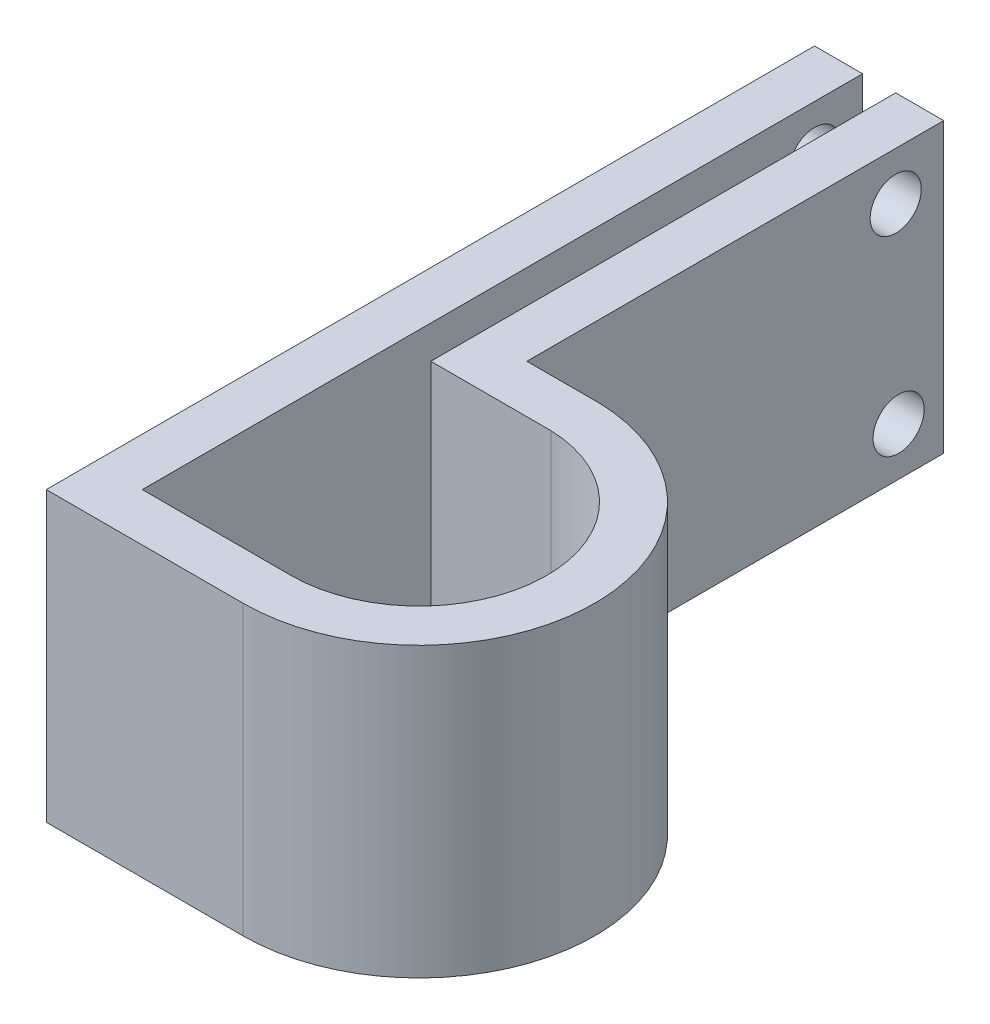
ISO-10303-21;
HEADER;
FILE_DESCRIPTION(('STEP AP214'),'2;1');
FILE_NAME('part.step','',(''),(''),'','','');
FILE_SCHEMA(('AUTOMOTIVE_DESIGN { 1 0 10303 214 1 1 1 1 }'));
ENDSEC;
DATA;
#1=APPLICATION_CONTEXT('core data for automotive mechanical design processes');
#2=APPLICATION_PROTOCOL_DEFINITION('international standard','automotive_design',2000,#1);
#3=PRODUCT_CONTEXT('',#1,'mechanical');
#4=PRODUCT('Part','Part','',(#3));
#5=PRODUCT_RELATED_PRODUCT_CATEGORY('part','',(#4));
#6=PRODUCT_DEFINITION_FORMATION('','',#4);
#7=PRODUCT_DEFINITION_CONTEXT('part definition',#1,'design');
#8=PRODUCT_DEFINITION('design','',#6,#7);
#9=PRODUCT_DEFINITION_SHAPE('','',#8);
#10=(LENGTH_UNIT() NAMED_UNIT(*) SI_UNIT(.MILLI.,.METRE.));
#11=(NAMED_UNIT(*) PLANE_ANGLE_UNIT() SI_UNIT($,.RADIAN.));
#12=(NAMED_UNIT(*) SI_UNIT($,.STERADIAN.) SOLID_ANGLE_UNIT());
#13=UNCERTAINTY_MEASURE_WITH_UNIT(LENGTH_MEASURE(1.E-05),#10,'distance_accuracy_value','');
#14=(GEOMETRIC_REPRESENTATION_CONTEXT(3) GLOBAL_UNCERTAINTY_ASSIGNED_CONTEXT((#13)) GLOBAL_UNIT_ASSIGNED_CONTEXT((#10,
#11,#12)) REPRESENTATION_CONTEXT('',''));
#15=CARTESIAN_POINT('',(0.,0.,0.));
#16=DIRECTION('',(0.,0.,1.));
#17=DIRECTION('',(1.,0.,0.));
#18=AXIS2_PLACEMENT_3D('',#15,#16,#17);
#19=CARTESIAN_POINT('',(0.,38.1,0.));
#20=DIRECTION('',(0.,-1.,0.));
#21=DIRECTION('',(0.,0.,-1.));
#22=AXIS2_PLACEMENT_3D('',#19,#20,#21);
#23=CYLINDRICAL_SURFACE('',#22,16.891);
#24=CARTESIAN_POINT('',(0.,0.,0.));
#25=DIRECTION('',(0.,-1.,0.));
#26=DIRECTION('',(0.,0.,-1.));
#27=AXIS2_PLACEMENT_3D('',#24,#25,#26);
#28=CIRCLE('',#27,16.891);
#29=CARTESIAN_POINT('',(0.563033333333334,0.,-16.8816135030262));
#30=VERTEX_POINT('',#29);
#31=CARTESIAN_POINT('',(-0.0084666666666616,0.,16.8909978780283));
#32=VERTEX_POINT('',#31);
#33=EDGE_CURVE('E166',#30,#32,#28,.T.);
#34=ORIENTED_EDGE('',*,*,#33,.T.);
#35=DIRECTION('',(0.,-1.,0.));
#36=VECTOR('',#35,1.);
#37=CARTESIAN_POINT('',(-0.0084666666666616,38.1,16.8909978780283));
#38=LINE('',#37,#36);
#39=CARTESIAN_POINT('',(-0.0084666666666616,38.1,16.8909978780283));
#40=VERTEX_POINT('',#39);
#41=EDGE_CURVE('E11',#40,#32,#38,.T.);
#42=ORIENTED_EDGE('',*,*,#41,.F.);
#43=CARTESIAN_POINT('',(0.,38.1,0.));
#44=DIRECTION('',(0.,-1.,0.));
#45=DIRECTION('',(0.,0.,-1.));
#46=AXIS2_PLACEMENT_3D('',#43,#44,#45);
#47=CIRCLE('',#46,16.891);
#48=CARTESIAN_POINT('',(0.563033333333334,38.1,-16.8816135030262));
#49=VERTEX_POINT('',#48);
#50=EDGE_CURVE('E201',#49,#40,#47,.T.);
#51=ORIENTED_EDGE('',*,*,#50,.F.);
#52=DIRECTION('',(0.,-1.,0.));
#53=VECTOR('',#52,1.);
#54=CARTESIAN_POINT('',(0.563033333333334,38.1,-16.8816135030262));
#55=LINE('',#54,#53);
#56=EDGE_CURVE('E162',#49,#30,#55,.T.);
#57=ORIENTED_EDGE('',*,*,#56,.T.);
#58=EDGE_LOOP('',(#34,#42,#51,#57));
#59=FACE_BOUND('',#58,.T.);
#60=ADVANCED_FACE('F39',(#59),#23,.F.);
#61=CARTESIAN_POINT('',(-0.0084666666666616,38.1,16.8909978780283));
#62=DIRECTION('',(0.,0.,1.));
#63=DIRECTION('',(1.,0.,0.));
#64=AXIS2_PLACEMENT_3D('',#61,#62,#63);
#65=PLANE('',#64);
#66=DIRECTION('',(-1.,0.,0.));
#67=VECTOR('',#66,1.);
#68=CARTESIAN_POINT('',(-0.0084666666666616,0.,16.8909978780283));
#69=LINE('',#68,#67);
#70=CARTESIAN_POINT('',(-19.6934666666667,0.,16.8909978780283));
#71=VERTEX_POINT('',#70);
#72=EDGE_CURVE('E170',#32,#71,#69,.T.);
#73=ORIENTED_EDGE('',*,*,#72,.T.);
#74=DIRECTION('',(0.,-1.,0.));
#75=VECTOR('',#74,1.);
#76=CARTESIAN_POINT('',(-19.6934666666667,38.1,16.8909978780283));
#77=LINE('',#76,#75);
#78=CARTESIAN_POINT('',(-19.6934666666667,38.1,16.8909978780283));
#79=VERTEX_POINT('',#78);
#80=EDGE_CURVE('E49',#79,#71,#77,.T.);
#81=ORIENTED_EDGE('',*,*,#80,.F.);
#82=DIRECTION('',(-1.,0.,0.));
#83=VECTOR('',#82,1.);
#84=CARTESIAN_POINT('',(-0.0084666666666616,38.1,16.8909978780283));
#85=LINE('',#84,#83);
#86=EDGE_CURVE('E113',#40,#79,#85,.T.);
#87=ORIENTED_EDGE('',*,*,#86,.F.);
#88=ORIENTED_EDGE('',*,*,#41,.T.);
#89=EDGE_LOOP('',(#73,#81,#87,#88));
#90=FACE_BOUND('',#89,.T.);
#91=ADVANCED_FACE('F310',(#90),#65,.F.);
#92=CARTESIAN_POINT('',(-19.6934666666667,38.1,16.8909978780283));
#93=DIRECTION('',(-1.,0.,0.));
#94=DIRECTION('',(0.,0.,1.));
#95=AXIS2_PLACEMENT_3D('',#92,#93,#94);
#96=PLANE('',#95);
#97=CARTESIAN_POINT('',(-19.6934666666667,31.75,-72.0090021219717));
#98=DIRECTION('',(-1.,0.,0.));
#99=DIRECTION('',(0.,0.,1.));
#100=AXIS2_PLACEMENT_3D('',#97,#98,#99);
#101=CIRCLE('',#100,3.37819999999999);
#102=CARTESIAN_POINT('',(-19.6934666666667,31.75,-68.6308021219717));
#103=VERTEX_POINT('',#102);
#104=EDGE_CURVE('E171',#103,#103,#101,.T.);
#105=ORIENTED_EDGE('',*,*,#104,.T.);
#106=EDGE_LOOP('',(#105));
#107=FACE_BOUND('',#106,.T.);
#108=CARTESIAN_POINT('',(-19.6934666666667,6.35285698606852,-72.3899571454477));
#109=DIRECTION('',(-1.,0.,0.));
#110=DIRECTION('',(0.,0.,1.));
#111=AXIS2_PLACEMENT_3D('',#108,#109,#110);
#112=CIRCLE('',#111,3.37819999999999);
#113=CARTESIAN_POINT('',(-19.6934666666667,6.35285698606852,-69.0117571454477));
#114=VERTEX_POINT('',#113);
#115=EDGE_CURVE('E237',#114,#114,#112,.T.);
#116=ORIENTED_EDGE('',*,*,#115,.T.);
#117=EDGE_LOOP('',(#116));
#118=FACE_BOUND('',#117,.T.);
#119=DIRECTION('',(0.,0.,-1.));
#120=VECTOR('',#119,1.);
#121=CARTESIAN_POINT('',(-19.6934666666667,0.,16.8909978780283));
#122=LINE('',#121,#120);
#123=CARTESIAN_POINT('',(-19.6934666666667,0.,-78.3590021219717));
#124=VERTEX_POINT('',#123);
#125=EDGE_CURVE('E174',#71,#124,#122,.T.);
#126=ORIENTED_EDGE('',*,*,#125,.T.);
#127=DIRECTION('',(0.,-1.,0.));
#128=VECTOR('',#127,1.);
#129=CARTESIAN_POINT('',(-19.6934666666667,38.1,-78.3590021219717));
#130=LINE('',#129,#128);
#131=CARTESIAN_POINT('',(-19.6934666666667,38.1,-78.3590021219717));
#132=VERTEX_POINT('',#131);
#133=EDGE_CURVE('E228',#132,#124,#130,.T.);
#134=ORIENTED_EDGE('',*,*,#133,.F.);
#135=DIRECTION('',(0.,0.,-1.));
#136=VECTOR('',#135,1.);
#137=CARTESIAN_POINT('',(-19.6934666666667,38.1,16.8909978780283));
#138=LINE('',#137,#136);
#139=EDGE_CURVE('E269',#79,#132,#138,.T.);
#140=ORIENTED_EDGE('',*,*,#139,.F.);
#141=ORIENTED_EDGE('',*,*,#80,.T.);
#142=EDGE_LOOP('',(#126,#134,#140,#141));
#143=FACE_BOUND('',#142,.T.);
#144=ADVANCED_FACE('F315',(#107,#118,#143),#96,.F.);
#145=CARTESIAN_POINT('',(-26.0434666666667,38.1,-78.3590021219717));
#146=DIRECTION('',(0.,0.,1.));
#147=DIRECTION('',(1.,0.,0.));
#148=AXIS2_PLACEMENT_3D('',#145,#146,#147);
#149=PLANE('',#148);
#150=DIRECTION('',(-1.,0.,0.));
#151=VECTOR('',#150,1.);
#152=CARTESIAN_POINT('',(-26.0434666666667,0.,-78.3590021219717));
#153=LINE('',#152,#151);
#154=CARTESIAN_POINT('',(-26.0434666666667,0.,-78.3590021219717));
#155=VERTEX_POINT('',#154);
#156=EDGE_CURVE('E177',#124,#155,#153,.T.);
#157=ORIENTED_EDGE('',*,*,#156,.T.);
#158=DIRECTION('',(0.,-1.,0.));
#159=VECTOR('',#158,1.);
#160=CARTESIAN_POINT('',(-26.0434666666667,38.1,-78.3590021219717));
#161=LINE('',#160,#159);
#162=CARTESIAN_POINT('',(-26.0434666666667,38.1,-78.3590021219717));
#163=VERTEX_POINT('',#162);
#164=EDGE_CURVE('E224',#163,#155,#161,.T.);
#165=ORIENTED_EDGE('',*,*,#164,.F.);
#166=DIRECTION('',(-1.,0.,0.));
#167=VECTOR('',#166,1.);
#168=CARTESIAN_POINT('',(-26.0434666666667,38.1,-78.3590021219717));
#169=LINE('',#168,#167);
#170=EDGE_CURVE('E272',#132,#163,#169,.T.);
#171=ORIENTED_EDGE('',*,*,#170,.F.);
#172=ORIENTED_EDGE('',*,*,#133,.T.);
#173=EDGE_LOOP('',(#157,#165,#171,#172));
#174=FACE_BOUND('',#173,.T.);
#175=ADVANCED_FACE('F330',(#174),#149,.F.);
#176=CARTESIAN_POINT('',(-26.0434666666667,38.1,23.2409978780283));
#177=DIRECTION('',(1.,0.,0.));
#178=DIRECTION('',(0.,0.,-1.));
#179=AXIS2_PLACEMENT_3D('',#176,#177,#178);
#180=PLANE('',#179);
#181=CARTESIAN_POINT('',(-26.0434666666667,31.75,-72.0090021219717));
#182=DIRECTION('',(1.,0.,0.));
#183=DIRECTION('',(0.,0.,-1.));
#184=AXIS2_PLACEMENT_3D('',#181,#182,#183);
#185=CIRCLE('',#184,3.37819999999999);
#186=CARTESIAN_POINT('',(-26.0434666666667,31.75,-75.3872021219717));
#187=VERTEX_POINT('',#186);
#188=EDGE_CURVE('E238',#187,#187,#185,.T.);
#189=ORIENTED_EDGE('',*,*,#188,.T.);
#190=EDGE_LOOP('',(#189));
#191=FACE_BOUND('',#190,.T.);
#192=CARTESIAN_POINT('',(-26.0434666666667,6.35285698606852,-72.3899571454477));
#193=DIRECTION('',(1.,0.,0.));
#194=DIRECTION('',(0.,0.,-1.));
#195=AXIS2_PLACEMENT_3D('',#192,#193,#194);
#196=CIRCLE('',#195,3.37819999999999);
#197=CARTESIAN_POINT('',(-26.0434666666667,6.35285698606852,-75.7681571454477));
#198=VERTEX_POINT('',#197);
#199=EDGE_CURVE('E252',#198,#198,#196,.T.);
#200=ORIENTED_EDGE('',*,*,#199,.T.);
#201=EDGE_LOOP('',(#200));
#202=FACE_BOUND('',#201,.T.);
#203=DIRECTION('',(0.,0.,1.));
#204=VECTOR('',#203,1.);
#205=CARTESIAN_POINT('',(-26.0434666666667,0.,23.2409978780283));
#206=LINE('',#205,#204);
#207=CARTESIAN_POINT('',(-26.0434666666667,0.,23.2409978780283));
#208=VERTEX_POINT('',#207);
#209=EDGE_CURVE('E180',#155,#208,#206,.T.);
#210=ORIENTED_EDGE('',*,*,#209,.T.);
#211=DIRECTION('',(0.,-1.,0.));
#212=VECTOR('',#211,1.);
#213=CARTESIAN_POINT('',(-26.0434666666667,38.1,23.2409978780283));
#214=LINE('',#213,#212);
#215=CARTESIAN_POINT('',(-26.0434666666667,38.1,23.2409978780283));
#216=VERTEX_POINT('',#215);
#217=EDGE_CURVE('E220',#216,#208,#214,.T.);
#218=ORIENTED_EDGE('',*,*,#217,.F.);
#219=DIRECTION('',(0.,0.,1.));
#220=VECTOR('',#219,1.);
#221=CARTESIAN_POINT('',(-26.0434666666667,38.1,23.2409978780283));
#222=LINE('',#221,#220);
#223=EDGE_CURVE('E275',#163,#216,#222,.T.);
#224=ORIENTED_EDGE('',*,*,#223,.F.);
#225=ORIENTED_EDGE('',*,*,#164,.T.);
#226=EDGE_LOOP('',(#210,#218,#224,#225));
#227=FACE_BOUND('',#226,.T.);
#228=ADVANCED_FACE('F333',(#191,#202,#227),#180,.F.);
#229=CARTESIAN_POINT('',(0.,38.1,23.2409978780283));
#230=DIRECTION('',(0.,0.,-1.));
#231=DIRECTION('',(-1.,0.,0.));
#232=AXIS2_PLACEMENT_3D('',#229,#230,#231);
#233=PLANE('',#232);
#234=DIRECTION('',(1.,0.,0.));
#235=VECTOR('',#234,1.);
#236=CARTESIAN_POINT('',(0.,0.,23.2409978780283));
#237=LINE('',#236,#235);
#238=CARTESIAN_POINT('',(0.,0.,23.2409978780283));
#239=VERTEX_POINT('',#238);
#240=EDGE_CURVE('E183',#208,#239,#237,.T.);
#241=ORIENTED_EDGE('',*,*,#240,.T.);
#242=DIRECTION('',(0.,-1.,0.));
#243=VECTOR('',#242,1.);
#244=CARTESIAN_POINT('',(0.,38.1,23.2409978780283));
#245=LINE('',#244,#243);
#246=CARTESIAN_POINT('',(0.,38.1,23.2409978780283));
#247=VERTEX_POINT('',#246);
#248=EDGE_CURVE('E216',#247,#239,#245,.T.);
#249=ORIENTED_EDGE('',*,*,#248,.F.);
#250=DIRECTION('',(1.,0.,0.));
#251=VECTOR('',#250,1.);
#252=CARTESIAN_POINT('',(0.,38.1,23.2409978780283));
#253=LINE('',#252,#251);
#254=EDGE_CURVE('E278',#216,#247,#253,.T.);
#255=ORIENTED_EDGE('',*,*,#254,.F.);
#256=ORIENTED_EDGE('',*,*,#217,.T.);
#257=EDGE_LOOP('',(#241,#249,#255,#256));
#258=FACE_BOUND('',#257,.T.);
#259=ADVANCED_FACE('F338',(#258),#233,.F.);
#260=CARTESIAN_POINT('',(0.,38.1,0.));
#261=DIRECTION('',(0.,-1.,0.));
#262=DIRECTION('',(0.,0.,-1.));
#263=AXIS2_PLACEMENT_3D('',#260,#261,#262);
#264=CYLINDRICAL_SURFACE('',#263,23.2409978780283);
#265=CARTESIAN_POINT('',(0.,0.,0.));
#266=DIRECTION('',(0.,1.,0.));
#267=DIRECTION('',(0.,0.,-1.));
#268=AXIS2_PLACEMENT_3D('',#265,#266,#267);
#269=CIRCLE('',#268,23.2409978780283);
#270=CARTESIAN_POINT('',(0.660391105729288,0.,-23.2316135030262));
#271=VERTEX_POINT('',#270);
#272=EDGE_CURVE('E186',#239,#271,#269,.T.);
#273=ORIENTED_EDGE('',*,*,#272,.T.);
#274=DIRECTION('',(0.,-1.,0.));
#275=VECTOR('',#274,1.);
#276=CARTESIAN_POINT('',(0.660391105729288,38.1,-23.2316135030262));
#277=LINE('',#276,#275);
#278=CARTESIAN_POINT('',(0.660391105729288,38.1,-23.2316135030262));
#279=VERTEX_POINT('',#278);
#280=EDGE_CURVE('E212',#279,#271,#277,.T.);
#281=ORIENTED_EDGE('',*,*,#280,.F.);
#282=CARTESIAN_POINT('',(0.,38.1,0.));
#283=DIRECTION('',(0.,1.,0.));
#284=DIRECTION('',(0.,0.,-1.));
#285=AXIS2_PLACEMENT_3D('',#282,#283,#284);
#286=CIRCLE('',#285,23.2409978780283);
#287=EDGE_CURVE('E281',#247,#279,#286,.T.);
#288=ORIENTED_EDGE('',*,*,#287,.F.);
#289=ORIENTED_EDGE('',*,*,#248,.T.);
#290=EDGE_LOOP('',(#273,#281,#288,#289));
#291=FACE_BOUND('',#290,.T.);
#292=ADVANCED_FACE('F344',(#291),#264,.T.);
#293=CARTESIAN_POINT('',(-8.96196666666666,38.1,-23.2316135030262));
#294=DIRECTION('',(0.,0.,1.));
#295=DIRECTION('',(1.,0.,0.));
#296=AXIS2_PLACEMENT_3D('',#293,#294,#295);
#297=PLANE('',#296);
#298=DIRECTION('',(-1.,0.,0.));
#299=VECTOR('',#298,1.);
#300=CARTESIAN_POINT('',(-8.96196666666666,0.,-23.2316135030262));
#301=LINE('',#300,#299);
#302=CARTESIAN_POINT('',(-8.96196666666666,0.,-23.2316135030262));
#303=VERTEX_POINT('',#302);
#304=EDGE_CURVE('E189',#271,#303,#301,.T.);
#305=ORIENTED_EDGE('',*,*,#304,.T.);
#306=DIRECTION('',(0.,-1.,0.));
#307=VECTOR('',#306,1.);
#308=CARTESIAN_POINT('',(-8.96196666666666,38.1,-23.2316135030262));
#309=LINE('',#308,#307);
#310=CARTESIAN_POINT('',(-8.96196666666666,38.1,-23.2316135030262));
#311=VERTEX_POINT('',#310);
#312=EDGE_CURVE('E208',#311,#303,#309,.T.);
#313=ORIENTED_EDGE('',*,*,#312,.F.);
#314=DIRECTION('',(-1.,0.,0.));
#315=VECTOR('',#314,1.);
#316=CARTESIAN_POINT('',(-8.96196666666666,38.1,-23.2316135030262));
#317=LINE('',#316,#315);
#318=EDGE_CURVE('E284',#279,#311,#317,.T.);
#319=ORIENTED_EDGE('',*,*,#318,.F.);
#320=ORIENTED_EDGE('',*,*,#280,.T.);
#321=EDGE_LOOP('',(#305,#313,#319,#320));
#322=FACE_BOUND('',#321,.T.);
#323=ADVANCED_FACE('F348',(#322),#297,.F.);
#324=CARTESIAN_POINT('',(-8.96196666666667,38.1,-78.3590021219717));
#325=DIRECTION('',(-1.,0.,0.));
#326=DIRECTION('',(0.,0.,1.));
#327=AXIS2_PLACEMENT_3D('',#324,#325,#326);
#328=PLANE('',#327);
#329=CARTESIAN_POINT('',(-8.96196666666667,31.75,-72.0090021219717));
#330=DIRECTION('',(1.,0.,0.));
#331=DIRECTION('',(0.,0.,-1.));
#332=AXIS2_PLACEMENT_3D('',#329,#330,#331);
#333=CIRCLE('',#332,3.37819999999999);
#334=CARTESIAN_POINT('',(-8.96196666666667,31.75,-75.3872021219717));
#335=VERTEX_POINT('',#334);
#336=EDGE_CURVE('E246',#335,#335,#333,.T.);
#337=ORIENTED_EDGE('',*,*,#336,.F.);
#338=EDGE_LOOP('',(#337));
#339=FACE_BOUND('',#338,.T.);
#340=CARTESIAN_POINT('',(-8.96196666666667,6.35285698606852,-72.3899571454477));
#341=DIRECTION('',(1.,0.,0.));
#342=DIRECTION('',(0.,0.,-1.));
#343=AXIS2_PLACEMENT_3D('',#340,#341,#342);
#344=CIRCLE('',#343,3.37819999999999);
#345=CARTESIAN_POINT('',(-8.96196666666667,6.35285698606852,-75.7681571454477));
#346=VERTEX_POINT('',#345);
#347=EDGE_CURVE('E258',#346,#346,#344,.T.);
#348=ORIENTED_EDGE('',*,*,#347,.F.);
#349=EDGE_LOOP('',(#348));
#350=FACE_BOUND('',#349,.T.);
#351=DIRECTION('',(0.,0.,-1.));
#352=VECTOR('',#351,1.);
#353=CARTESIAN_POINT('',(-8.96196666666667,0.,-78.3590021219717));
#354=LINE('',#353,#352);
#355=CARTESIAN_POINT('',(-8.96196666666667,0.,-78.3590021219717));
#356=VERTEX_POINT('',#355);
#357=EDGE_CURVE('E192',#303,#356,#354,.T.);
#358=ORIENTED_EDGE('',*,*,#357,.T.);
#359=DIRECTION('',(0.,-1.,0.));
#360=VECTOR('',#359,1.);
#361=CARTESIAN_POINT('',(-8.96196666666667,38.1,-78.3590021219717));
#362=LINE('',#361,#360);
#363=CARTESIAN_POINT('',(-8.96196666666667,38.1,-78.3590021219717));
#364=VERTEX_POINT('',#363);
#365=EDGE_CURVE('E155',#364,#356,#362,.T.);
#366=ORIENTED_EDGE('',*,*,#365,.F.);
#367=DIRECTION('',(0.,0.,-1.));
#368=VECTOR('',#367,1.);
#369=CARTESIAN_POINT('',(-8.96196666666667,38.1,-78.3590021219717));
#370=LINE('',#369,#368);
#371=EDGE_CURVE('E144',#311,#364,#370,.T.);
#372=ORIENTED_EDGE('',*,*,#371,.F.);
#373=ORIENTED_EDGE('',*,*,#312,.T.);
#374=EDGE_LOOP('',(#358,#366,#372,#373));
#375=FACE_BOUND('',#374,.T.);
#376=ADVANCED_FACE('F351',(#339,#350,#375),#328,.F.);
#377=CARTESIAN_POINT('',(-15.3119666666667,38.1,-78.3590021219717));
#378=DIRECTION('',(0.,0.,1.));
#379=DIRECTION('',(1.,0.,0.));
#380=AXIS2_PLACEMENT_3D('',#377,#378,#379);
#381=PLANE('',#380);
#382=DIRECTION('',(-1.,0.,0.));
#383=VECTOR('',#382,1.);
#384=CARTESIAN_POINT('',(-15.3119666666667,0.,-78.3590021219717));
#385=LINE('',#384,#383);
#386=CARTESIAN_POINT('',(-15.3119666666667,0.,-78.3590021219717));
#387=VERTEX_POINT('',#386);
#388=EDGE_CURVE('E153',#356,#387,#385,.T.);
#389=ORIENTED_EDGE('',*,*,#388,.T.);
#390=DIRECTION('',(0.,-1.,0.));
#391=VECTOR('',#390,1.);
#392=CARTESIAN_POINT('',(-15.3119666666667,38.1,-78.3590021219717));
#393=LINE('',#392,#391);
#394=CARTESIAN_POINT('',(-15.3119666666667,38.1,-78.3590021219717));
#395=VERTEX_POINT('',#394);
#396=EDGE_CURVE('E150',#395,#387,#393,.T.);
#397=ORIENTED_EDGE('',*,*,#396,.F.);
#398=DIRECTION('',(-1.,0.,0.));
#399=VECTOR('',#398,1.);
#400=CARTESIAN_POINT('',(-15.3119666666667,38.1,-78.3590021219717));
#401=LINE('',#400,#399);
#402=EDGE_CURVE('E138',#364,#395,#401,.T.);
#403=ORIENTED_EDGE('',*,*,#402,.F.);
#404=ORIENTED_EDGE('',*,*,#365,.T.);
#405=EDGE_LOOP('',(#389,#397,#403,#404));
#406=FACE_BOUND('',#405,.T.);
#407=ADVANCED_FACE('F151',(#406),#381,.F.);
#408=CARTESIAN_POINT('',(-15.3119666666667,38.1,-16.8816135030262));
#409=DIRECTION('',(1.,0.,0.));
#410=DIRECTION('',(0.,0.,-1.));
#411=AXIS2_PLACEMENT_3D('',#408,#409,#410);
#412=PLANE('',#411);
#413=CARTESIAN_POINT('',(-15.3119666666667,31.75,-72.0090021219717));
#414=DIRECTION('',(1.,0.,0.));
#415=DIRECTION('',(0.,0.,-1.));
#416=AXIS2_PLACEMENT_3D('',#413,#414,#415);
#417=CIRCLE('',#416,3.37819999999999);
#418=CARTESIAN_POINT('',(-15.3119666666667,31.75,-75.3872021219717));
#419=VERTEX_POINT('',#418);
#420=EDGE_CURVE('E42',#419,#419,#417,.T.);
#421=ORIENTED_EDGE('',*,*,#420,.T.);
#422=EDGE_LOOP('',(#421));
#423=FACE_BOUND('',#422,.T.);
#424=CARTESIAN_POINT('',(-15.3119666666667,6.35285698606852,-72.3899571454477));
#425=DIRECTION('',(1.,0.,0.));
#426=DIRECTION('',(0.,0.,-1.));
#427=AXIS2_PLACEMENT_3D('',#424,#425,#426);
#428=CIRCLE('',#427,3.37819999999999);
#429=CARTESIAN_POINT('',(-15.3119666666667,6.35285698606852,-75.7681571454477));
#430=VERTEX_POINT('',#429);
#431=EDGE_CURVE('E234',#430,#430,#428,.T.);
#432=ORIENTED_EDGE('',*,*,#431,.T.);
#433=EDGE_LOOP('',(#432));
#434=FACE_BOUND('',#433,.T.);
#435=DIRECTION('',(0.,0.,1.));
#436=VECTOR('',#435,1.);
#437=CARTESIAN_POINT('',(-15.3119666666667,0.,-16.8816135030262));
#438=LINE('',#437,#436);
#439=CARTESIAN_POINT('',(-15.3119666666667,0.,-16.8816135030262));
#440=VERTEX_POINT('',#439);
#441=EDGE_CURVE('E99',#387,#440,#438,.T.);
#442=ORIENTED_EDGE('',*,*,#441,.T.);
#443=DIRECTION('',(0.,-1.,0.));
#444=VECTOR('',#443,1.);
#445=CARTESIAN_POINT('',(-15.3119666666667,38.1,-16.8816135030262));
#446=LINE('',#445,#444);
#447=CARTESIAN_POINT('',(-15.3119666666667,38.1,-16.8816135030262));
#448=VERTEX_POINT('',#447);
#449=EDGE_CURVE('E156',#448,#440,#446,.T.);
#450=ORIENTED_EDGE('',*,*,#449,.F.);
#451=DIRECTION('',(0.,0.,1.));
#452=VECTOR('',#451,1.);
#453=CARTESIAN_POINT('',(-15.3119666666667,38.1,-16.8816135030262));
#454=LINE('',#453,#452);
#455=EDGE_CURVE('E142',#395,#448,#454,.T.);
#456=ORIENTED_EDGE('',*,*,#455,.F.);
#457=ORIENTED_EDGE('',*,*,#396,.T.);
#458=EDGE_LOOP('',(#442,#450,#456,#457));
#459=FACE_BOUND('',#458,.T.);
#460=ADVANCED_FACE('F158',(#423,#434,#459),#412,.F.);
#461=CARTESIAN_POINT('',(0.563033333333334,38.1,-16.8816135030262));
#462=DIRECTION('',(0.,0.,-1.));
#463=DIRECTION('',(-1.,0.,0.));
#464=AXIS2_PLACEMENT_3D('',#461,#462,#463);
#465=PLANE('',#464);
#466=DIRECTION('',(1.,0.,0.));
#467=VECTOR('',#466,1.);
#468=CARTESIAN_POINT('',(0.563033333333334,0.,-16.8816135030262));
#469=LINE('',#468,#467);
#470=EDGE_CURVE('E105',#440,#30,#469,.T.);
#471=ORIENTED_EDGE('',*,*,#470,.T.);
#472=ORIENTED_EDGE('',*,*,#56,.F.);
#473=DIRECTION('',(1.,0.,0.));
#474=VECTOR('',#473,1.);
#475=CARTESIAN_POINT('',(0.563033333333334,38.1,-16.8816135030262));
#476=LINE('',#475,#474);
#477=EDGE_CURVE('E58',#448,#49,#476,.T.);
#478=ORIENTED_EDGE('',*,*,#477,.F.);
#479=ORIENTED_EDGE('',*,*,#449,.T.);
#480=EDGE_LOOP('',(#471,#472,#478,#479));
#481=FACE_BOUND('',#480,.T.);
#482=ADVANCED_FACE('F419',(#481),#465,.F.);
#483=CARTESIAN_POINT('',(0.,38.1,0.));
#484=DIRECTION('',(0.,-1.,0.));
#485=DIRECTION('',(0.,0.,-1.));
#486=AXIS2_PLACEMENT_3D('',#483,#484,#485);
#487=PLANE('',#486);
#488=ORIENTED_EDGE('',*,*,#50,.T.);
#489=ORIENTED_EDGE('',*,*,#86,.T.);
#490=ORIENTED_EDGE('',*,*,#139,.T.);
#491=ORIENTED_EDGE('',*,*,#170,.T.);
#492=ORIENTED_EDGE('',*,*,#223,.T.);
#493=ORIENTED_EDGE('',*,*,#254,.T.);
#494=ORIENTED_EDGE('',*,*,#287,.T.);
#495=ORIENTED_EDGE('',*,*,#318,.T.);
#496=ORIENTED_EDGE('',*,*,#371,.T.);
#497=ORIENTED_EDGE('',*,*,#402,.T.);
#498=ORIENTED_EDGE('',*,*,#455,.T.);
#499=ORIENTED_EDGE('',*,*,#477,.T.);
#500=EDGE_LOOP('',(#488,#489,#490,#491,#492,#493,#494,#495,#496,#497,#498,#499));
#501=FACE_BOUND('',#500,.T.);
#502=ADVANCED_FACE('F140',(#501),#487,.F.);
#503=CARTESIAN_POINT('',(0.,0.,0.));
#504=DIRECTION('',(0.,-1.,0.));
#505=DIRECTION('',(0.,0.,-1.));
#506=AXIS2_PLACEMENT_3D('',#503,#504,#505);
#507=PLANE('',#506);
#508=ORIENTED_EDGE('',*,*,#33,.F.);
#509=ORIENTED_EDGE('',*,*,#470,.F.);
#510=ORIENTED_EDGE('',*,*,#441,.F.);
#511=ORIENTED_EDGE('',*,*,#388,.F.);
#512=ORIENTED_EDGE('',*,*,#357,.F.);
#513=ORIENTED_EDGE('',*,*,#304,.F.);
#514=ORIENTED_EDGE('',*,*,#272,.F.);
#515=ORIENTED_EDGE('',*,*,#240,.F.);
#516=ORIENTED_EDGE('',*,*,#209,.F.);
#517=ORIENTED_EDGE('',*,*,#156,.F.);
#518=ORIENTED_EDGE('',*,*,#125,.F.);
#519=ORIENTED_EDGE('',*,*,#72,.F.);
#520=EDGE_LOOP('',(#508,#509,#510,#511,#512,#513,#514,#515,#516,#517,#518,#519));
#521=FACE_BOUND('',#520,.T.);
#522=ADVANCED_FACE('F305',(#521),#507,.T.);
#523=CARTESIAN_POINT('',(-26.0434666666667,6.35285698606852,-72.3899571454477));
#524=DIRECTION('',(1.,0.,0.));
#525=DIRECTION('',(0.,0.,-1.));
#526=AXIS2_PLACEMENT_3D('',#523,#524,#525);
#527=CYLINDRICAL_SURFACE('',#526,3.37819999999999);
#528=ORIENTED_EDGE('',*,*,#347,.T.);
#529=EDGE_LOOP('',(#528));
#530=FACE_BOUND('',#529,.T.);
#531=ORIENTED_EDGE('',*,*,#431,.F.);
#532=EDGE_LOOP('',(#531));
#533=FACE_BOUND('',#532,.T.);
#534=ADVANCED_FACE('F295',(#530,#533),#527,.F.);
#535=CARTESIAN_POINT('',(-26.0434666666667,31.75,-72.0090021219717));
#536=DIRECTION('',(1.,0.,0.));
#537=DIRECTION('',(0.,0.,-1.));
#538=AXIS2_PLACEMENT_3D('',#535,#536,#537);
#539=CYLINDRICAL_SURFACE('',#538,3.37819999999999);
#540=ORIENTED_EDGE('',*,*,#336,.T.);
#541=EDGE_LOOP('',(#540));
#542=FACE_BOUND('',#541,.T.);
#543=ORIENTED_EDGE('',*,*,#420,.F.);
#544=EDGE_LOOP('',(#543));
#545=FACE_BOUND('',#544,.T.);
#546=ADVANCED_FACE('F292',(#542,#545),#539,.F.);
#547=ORIENTED_EDGE('',*,*,#199,.F.);
#548=EDGE_LOOP('',(#547));
#549=FACE_BOUND('',#548,.T.);
#550=ORIENTED_EDGE('',*,*,#115,.F.);
#551=EDGE_LOOP('',(#550));
#552=FACE_BOUND('',#551,.T.);
#553=ADVANCED_FACE('F294',(#549,#552),#527,.F.);
#554=ORIENTED_EDGE('',*,*,#188,.F.);
#555=EDGE_LOOP('',(#554));
#556=FACE_BOUND('',#555,.T.);
#557=ORIENTED_EDGE('',*,*,#104,.F.);
#558=EDGE_LOOP('',(#557));
#559=FACE_BOUND('',#558,.T.);
#560=ADVANCED_FACE('F298',(#556,#559),#539,.F.);
#561=CLOSED_SHELL('',(#60,#91,#144,#175,#228,#259,#292,#323,#376,#407,#460,#482,#502,#522,#534,
#546,#553,#560));
#562=MANIFOLD_SOLID_BREP('B2',#561);
#563=ADVANCED_BREP_SHAPE_REPRESENTATION('',(#18,#562),#14);
#564=SHAPE_DEFINITION_REPRESENTATION(#9,#563);
ENDSEC;
END-ISO-10303-21;
